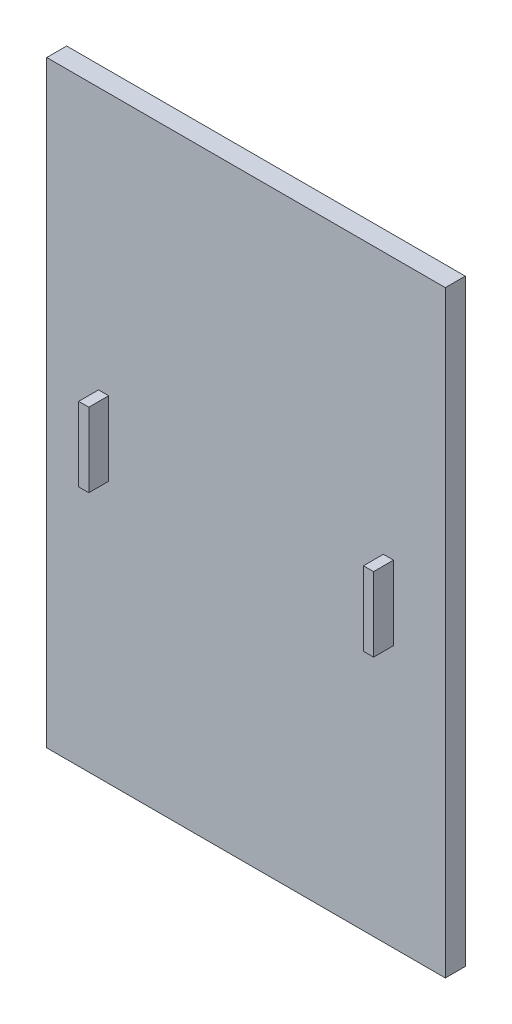
ISO-10303-21;
HEADER;
FILE_DESCRIPTION(('STEP AP214'),'2;1');
FILE_NAME('part.step','',(''),(''),'','','');
FILE_SCHEMA(('AUTOMOTIVE_DESIGN { 1 0 10303 214 1 1 1 1 }'));
ENDSEC;
DATA;
#1=APPLICATION_CONTEXT('core data for automotive mechanical design processes');
#2=APPLICATION_PROTOCOL_DEFINITION('international standard','automotive_design',2000,#1);
#3=PRODUCT_CONTEXT('',#1,'mechanical');
#4=PRODUCT('Part','Part','',(#3));
#5=PRODUCT_RELATED_PRODUCT_CATEGORY('part','',(#4));
#6=PRODUCT_DEFINITION_FORMATION('','',#4);
#7=PRODUCT_DEFINITION_CONTEXT('part definition',#1,'design');
#8=PRODUCT_DEFINITION('design','',#6,#7);
#9=PRODUCT_DEFINITION_SHAPE('','',#8);
#10=(LENGTH_UNIT() NAMED_UNIT(*) SI_UNIT(.MILLI.,.METRE.));
#11=(NAMED_UNIT(*) PLANE_ANGLE_UNIT() SI_UNIT($,.RADIAN.));
#12=(NAMED_UNIT(*) SI_UNIT($,.STERADIAN.) SOLID_ANGLE_UNIT());
#13=UNCERTAINTY_MEASURE_WITH_UNIT(LENGTH_MEASURE(1.E-05),#10,'distance_accuracy_value','');
#14=(GEOMETRIC_REPRESENTATION_CONTEXT(3) GLOBAL_UNCERTAINTY_ASSIGNED_CONTEXT((#13)) GLOBAL_UNIT_ASSIGNED_CONTEXT((#10,
#11,#12)) REPRESENTATION_CONTEXT('',''));
#15=CARTESIAN_POINT('',(0.,0.,0.));
#16=DIRECTION('',(0.,0.,1.));
#17=DIRECTION('',(1.,0.,0.));
#18=AXIS2_PLACEMENT_3D('',#15,#16,#17);
#19=CARTESIAN_POINT('',(0.,0.,5.));
#20=DIRECTION('',(0.,0.,1.));
#21=DIRECTION('',(1.,0.,0.));
#22=AXIS2_PLACEMENT_3D('',#19,#20,#21);
#23=PLANE('',#22);
#24=DIRECTION('',(0.,1.,0.));
#25=VECTOR('',#24,1.);
#26=CARTESIAN_POINT('',(34.4518078033703,9.29189619173818,5.));
#27=LINE('',#26,#25);
#28=CARTESIAN_POINT('',(34.4518078033703,-9.29189619173818,5.));
#29=VERTEX_POINT('',#28);
#30=CARTESIAN_POINT('',(34.4518078033703,9.29189619173818,5.));
#31=VERTEX_POINT('',#30);
#32=EDGE_CURVE('E127',#29,#31,#27,.T.);
#33=ORIENTED_EDGE('',*,*,#32,.T.);
#34=DIRECTION('',(1.,0.,0.));
#35=VECTOR('',#34,1.);
#36=CARTESIAN_POINT('',(36.99502297154,9.29189619173818,5.));
#37=LINE('',#36,#35);
#38=CARTESIAN_POINT('',(36.99502297154,9.29189619173818,5.));
#39=VERTEX_POINT('',#38);
#40=EDGE_CURVE('E141',#31,#39,#37,.T.);
#41=ORIENTED_EDGE('',*,*,#40,.T.);
#42=DIRECTION('',(0.,-1.,0.));
#43=VECTOR('',#42,1.);
#44=CARTESIAN_POINT('',(36.99502297154,9.29189619173818,5.));
#45=LINE('',#44,#43);
#46=CARTESIAN_POINT('',(36.99502297154,-9.29189619173818,5.));
#47=VERTEX_POINT('',#46);
#48=EDGE_CURVE('E53',#39,#47,#45,.T.);
#49=ORIENTED_EDGE('',*,*,#48,.T.);
#50=DIRECTION('',(-1.,0.,0.));
#51=VECTOR('',#50,1.);
#52=CARTESIAN_POINT('',(36.99502297154,-9.29189619173818,5.));
#53=LINE('',#52,#51);
#54=EDGE_CURVE('E48',#47,#29,#53,.T.);
#55=ORIENTED_EDGE('',*,*,#54,.T.);
#56=EDGE_LOOP('',(#33,#41,#49,#55));
#57=FACE_BOUND('',#56,.T.);
#58=DIRECTION('',(0.,1.,0.));
#59=VECTOR('',#58,1.);
#60=CARTESIAN_POINT('',(50.,75.,5.));
#61=LINE('',#60,#59);
#62=CARTESIAN_POINT('',(50.,-75.,5.));
#63=VERTEX_POINT('',#62);
#64=CARTESIAN_POINT('',(50.,75.,5.));
#65=VERTEX_POINT('',#64);
#66=EDGE_CURVE('E188',#63,#65,#61,.T.);
#67=ORIENTED_EDGE('',*,*,#66,.T.);
#68=DIRECTION('',(-1.,0.,0.));
#69=VECTOR('',#68,1.);
#70=CARTESIAN_POINT('',(-50.,75.,5.));
#71=LINE('',#70,#69);
#72=CARTESIAN_POINT('',(-50.,75.,5.));
#73=VERTEX_POINT('',#72);
#74=EDGE_CURVE('E191',#65,#73,#71,.T.);
#75=ORIENTED_EDGE('',*,*,#74,.T.);
#76=DIRECTION('',(0.,-1.,0.));
#77=VECTOR('',#76,1.);
#78=CARTESIAN_POINT('',(-50.,75.,5.));
#79=LINE('',#78,#77);
#80=CARTESIAN_POINT('',(-50.,-75.,5.));
#81=VERTEX_POINT('',#80);
#82=EDGE_CURVE('E194',#73,#81,#79,.T.);
#83=ORIENTED_EDGE('',*,*,#82,.T.);
#84=DIRECTION('',(1.,0.,0.));
#85=VECTOR('',#84,1.);
#86=CARTESIAN_POINT('',(-50.,-75.,5.));
#87=LINE('',#86,#85);
#88=EDGE_CURVE('E196',#81,#63,#87,.T.);
#89=ORIENTED_EDGE('',*,*,#88,.T.);
#90=EDGE_LOOP('',(#67,#75,#83,#89));
#91=FACE_BOUND('',#90,.T.);
#92=DIRECTION('',(-1.,0.,0.));
#93=VECTOR('',#92,1.);
#94=CARTESIAN_POINT('',(-36.99502297154,9.29189619173818,5.));
#95=LINE('',#94,#93);
#96=CARTESIAN_POINT('',(-34.4518078033703,9.29189619173818,5.));
#97=VERTEX_POINT('',#96);
#98=CARTESIAN_POINT('',(-36.99502297154,9.29189619173818,5.));
#99=VERTEX_POINT('',#98);
#100=EDGE_CURVE('E172',#97,#99,#95,.T.);
#101=ORIENTED_EDGE('',*,*,#100,.F.);
#102=DIRECTION('',(0.,1.,0.));
#103=VECTOR('',#102,1.);
#104=CARTESIAN_POINT('',(-34.4518078033703,9.29189619173818,5.));
#105=LINE('',#104,#103);
#106=CARTESIAN_POINT('',(-34.4518078033703,-9.29189619173818,5.));
#107=VERTEX_POINT('',#106);
#108=EDGE_CURVE('E130',#107,#97,#105,.T.);
#109=ORIENTED_EDGE('',*,*,#108,.F.);
#110=DIRECTION('',(1.,0.,0.));
#111=VECTOR('',#110,1.);
#112=CARTESIAN_POINT('',(-36.99502297154,-9.29189619173818,5.));
#113=LINE('',#112,#111);
#114=CARTESIAN_POINT('',(-36.99502297154,-9.29189619173818,5.));
#115=VERTEX_POINT('',#114);
#116=EDGE_CURVE('E163',#115,#107,#113,.T.);
#117=ORIENTED_EDGE('',*,*,#116,.F.);
#118=DIRECTION('',(0.,-1.,0.));
#119=VECTOR('',#118,1.);
#120=CARTESIAN_POINT('',(-36.99502297154,9.29189619173818,5.));
#121=LINE('',#120,#119);
#122=EDGE_CURVE('E174',#99,#115,#121,.T.);
#123=ORIENTED_EDGE('',*,*,#122,.F.);
#124=EDGE_LOOP('',(#101,#109,#117,#123));
#125=FACE_BOUND('',#124,.T.);
#126=ADVANCED_FACE('F33',(#57,#91,#125),#23,.T.);
#127=CARTESIAN_POINT('',(50.,75.,5.));
#128=DIRECTION('',(-1.,0.,0.));
#129=DIRECTION('',(0.,-1.,0.));
#130=AXIS2_PLACEMENT_3D('',#127,#128,#129);
#131=PLANE('',#130);
#132=DIRECTION('',(0.,1.,0.));
#133=VECTOR('',#132,1.);
#134=CARTESIAN_POINT('',(50.,75.,0.));
#135=LINE('',#134,#133);
#136=CARTESIAN_POINT('',(50.,-75.,0.));
#137=VERTEX_POINT('',#136);
#138=CARTESIAN_POINT('',(50.,75.,0.));
#139=VERTEX_POINT('',#138);
#140=EDGE_CURVE('E187',#137,#139,#135,.T.);
#141=ORIENTED_EDGE('',*,*,#140,.T.);
#142=DIRECTION('',(0.,0.,-1.));
#143=VECTOR('',#142,1.);
#144=CARTESIAN_POINT('',(50.,75.,5.));
#145=LINE('',#144,#143);
#146=EDGE_CURVE('E11',#65,#139,#145,.T.);
#147=ORIENTED_EDGE('',*,*,#146,.F.);
#148=ORIENTED_EDGE('',*,*,#66,.F.);
#149=DIRECTION('',(0.,0.,-1.));
#150=VECTOR('',#149,1.);
#151=CARTESIAN_POINT('',(50.,-75.,5.));
#152=LINE('',#151,#150);
#153=EDGE_CURVE('E198',#63,#137,#152,.T.);
#154=ORIENTED_EDGE('',*,*,#153,.T.);
#155=EDGE_LOOP('',(#141,#147,#148,#154));
#156=FACE_BOUND('',#155,.T.);
#157=ADVANCED_FACE('F35',(#156),#131,.F.);
#158=CARTESIAN_POINT('',(-50.,75.,5.));
#159=DIRECTION('',(0.,-1.,0.));
#160=DIRECTION('',(0.,0.,-1.));
#161=AXIS2_PLACEMENT_3D('',#158,#159,#160);
#162=PLANE('',#161);
#163=DIRECTION('',(-1.,0.,0.));
#164=VECTOR('',#163,1.);
#165=CARTESIAN_POINT('',(-50.,75.,0.));
#166=LINE('',#165,#164);
#167=CARTESIAN_POINT('',(-50.,75.,0.));
#168=VERTEX_POINT('',#167);
#169=EDGE_CURVE('E201',#139,#168,#166,.T.);
#170=ORIENTED_EDGE('',*,*,#169,.T.);
#171=DIRECTION('',(0.,0.,-1.));
#172=VECTOR('',#171,1.);
#173=CARTESIAN_POINT('',(-50.,75.,5.));
#174=LINE('',#173,#172);
#175=EDGE_CURVE('E41',#73,#168,#174,.T.);
#176=ORIENTED_EDGE('',*,*,#175,.F.);
#177=ORIENTED_EDGE('',*,*,#74,.F.);
#178=ORIENTED_EDGE('',*,*,#146,.T.);
#179=EDGE_LOOP('',(#170,#176,#177,#178));
#180=FACE_BOUND('',#179,.T.);
#181=ADVANCED_FACE('F231',(#180),#162,.F.);
#182=CARTESIAN_POINT('',(-50.,75.,5.));
#183=DIRECTION('',(1.,0.,0.));
#184=DIRECTION('',(0.,1.,0.));
#185=AXIS2_PLACEMENT_3D('',#182,#183,#184);
#186=PLANE('',#185);
#187=DIRECTION('',(0.,-1.,0.));
#188=VECTOR('',#187,1.);
#189=CARTESIAN_POINT('',(-50.,75.,0.));
#190=LINE('',#189,#188);
#191=CARTESIAN_POINT('',(-50.,-75.,0.));
#192=VERTEX_POINT('',#191);
#193=EDGE_CURVE('E203',#168,#192,#190,.T.);
#194=ORIENTED_EDGE('',*,*,#193,.T.);
#195=DIRECTION('',(0.,0.,-1.));
#196=VECTOR('',#195,1.);
#197=CARTESIAN_POINT('',(-50.,-75.,5.));
#198=LINE('',#197,#196);
#199=EDGE_CURVE('E208',#81,#192,#198,.T.);
#200=ORIENTED_EDGE('',*,*,#199,.F.);
#201=ORIENTED_EDGE('',*,*,#82,.F.);
#202=ORIENTED_EDGE('',*,*,#175,.T.);
#203=EDGE_LOOP('',(#194,#200,#201,#202));
#204=FACE_BOUND('',#203,.T.);
#205=ADVANCED_FACE('F215',(#204),#186,.F.);
#206=CARTESIAN_POINT('',(-50.,-75.,5.));
#207=DIRECTION('',(0.,1.,0.));
#208=DIRECTION('',(0.,0.,1.));
#209=AXIS2_PLACEMENT_3D('',#206,#207,#208);
#210=PLANE('',#209);
#211=DIRECTION('',(1.,0.,0.));
#212=VECTOR('',#211,1.);
#213=CARTESIAN_POINT('',(-50.,-75.,0.));
#214=LINE('',#213,#212);
#215=EDGE_CURVE('E192',#192,#137,#214,.T.);
#216=ORIENTED_EDGE('',*,*,#215,.T.);
#217=ORIENTED_EDGE('',*,*,#153,.F.);
#218=ORIENTED_EDGE('',*,*,#88,.F.);
#219=ORIENTED_EDGE('',*,*,#199,.T.);
#220=EDGE_LOOP('',(#216,#217,#218,#219));
#221=FACE_BOUND('',#220,.T.);
#222=ADVANCED_FACE('F224',(#221),#210,.F.);
#223=CARTESIAN_POINT('',(0.,0.,0.));
#224=DIRECTION('',(0.,0.,1.));
#225=DIRECTION('',(1.,0.,0.));
#226=AXIS2_PLACEMENT_3D('',#223,#224,#225);
#227=PLANE('',#226);
#228=ORIENTED_EDGE('',*,*,#140,.F.);
#229=ORIENTED_EDGE('',*,*,#215,.F.);
#230=ORIENTED_EDGE('',*,*,#193,.F.);
#231=ORIENTED_EDGE('',*,*,#169,.F.);
#232=EDGE_LOOP('',(#228,#229,#230,#231));
#233=FACE_BOUND('',#232,.T.);
#234=ADVANCED_FACE('F221',(#233),#227,.F.);
#235=CARTESIAN_POINT('',(-34.4518078033703,9.29189619173818,10.));
#236=DIRECTION('',(-1.,0.,0.));
#237=DIRECTION('',(0.,0.,1.));
#238=AXIS2_PLACEMENT_3D('',#235,#236,#237);
#239=PLANE('',#238);
#240=ORIENTED_EDGE('',*,*,#108,.T.);
#241=DIRECTION('',(0.,0.,-1.));
#242=VECTOR('',#241,1.);
#243=CARTESIAN_POINT('',(-34.4518078033703,9.29189619173818,10.));
#244=LINE('',#243,#242);
#245=CARTESIAN_POINT('',(-34.4518078033703,9.29189619173818,10.));
#246=VERTEX_POINT('',#245);
#247=EDGE_CURVE('E185',#246,#97,#244,.T.);
#248=ORIENTED_EDGE('',*,*,#247,.F.);
#249=DIRECTION('',(0.,1.,0.));
#250=VECTOR('',#249,1.);
#251=CARTESIAN_POINT('',(-34.4518078033703,9.29189619173818,10.));
#252=LINE('',#251,#250);
#253=CARTESIAN_POINT('',(-34.4518078033703,-9.29189619173818,10.));
#254=VERTEX_POINT('',#253);
#255=EDGE_CURVE('E159',#254,#246,#252,.T.);
#256=ORIENTED_EDGE('',*,*,#255,.F.);
#257=DIRECTION('',(0.,0.,-1.));
#258=VECTOR('',#257,1.);
#259=CARTESIAN_POINT('',(-34.4518078033703,-9.29189619173818,10.));
#260=LINE('',#259,#258);
#261=EDGE_CURVE('E169',#254,#107,#260,.T.);
#262=ORIENTED_EDGE('',*,*,#261,.T.);
#263=EDGE_LOOP('',(#240,#248,#256,#262));
#264=FACE_BOUND('',#263,.T.);
#265=ADVANCED_FACE('F244',(#264),#239,.F.);
#266=CARTESIAN_POINT('',(-36.99502297154,9.29189619173818,10.));
#267=DIRECTION('',(0.,-1.,0.));
#268=DIRECTION('',(0.,0.,-1.));
#269=AXIS2_PLACEMENT_3D('',#266,#267,#268);
#270=PLANE('',#269);
#271=ORIENTED_EDGE('',*,*,#100,.T.);
#272=DIRECTION('',(0.,0.,-1.));
#273=VECTOR('',#272,1.);
#274=CARTESIAN_POINT('',(-36.99502297154,9.29189619173818,10.));
#275=LINE('',#274,#273);
#276=CARTESIAN_POINT('',(-36.99502297154,9.29189619173818,10.));
#277=VERTEX_POINT('',#276);
#278=EDGE_CURVE('E182',#277,#99,#275,.T.);
#279=ORIENTED_EDGE('',*,*,#278,.F.);
#280=DIRECTION('',(-1.,0.,0.));
#281=VECTOR('',#280,1.);
#282=CARTESIAN_POINT('',(-36.99502297154,9.29189619173818,10.));
#283=LINE('',#282,#281);
#284=EDGE_CURVE('E162',#246,#277,#283,.T.);
#285=ORIENTED_EDGE('',*,*,#284,.F.);
#286=ORIENTED_EDGE('',*,*,#247,.T.);
#287=EDGE_LOOP('',(#271,#279,#285,#286));
#288=FACE_BOUND('',#287,.T.);
#289=ADVANCED_FACE('F263',(#288),#270,.F.);
#290=CARTESIAN_POINT('',(-36.99502297154,9.29189619173818,10.));
#291=DIRECTION('',(1.,0.,0.));
#292=DIRECTION('',(0.,0.,-1.));
#293=AXIS2_PLACEMENT_3D('',#290,#291,#292);
#294=PLANE('',#293);
#295=ORIENTED_EDGE('',*,*,#122,.T.);
#296=DIRECTION('',(0.,0.,-1.));
#297=VECTOR('',#296,1.);
#298=CARTESIAN_POINT('',(-36.99502297154,-9.29189619173818,10.));
#299=LINE('',#298,#297);
#300=CARTESIAN_POINT('',(-36.99502297154,-9.29189619173818,10.));
#301=VERTEX_POINT('',#300);
#302=EDGE_CURVE('E180',#301,#115,#299,.T.);
#303=ORIENTED_EDGE('',*,*,#302,.F.);
#304=DIRECTION('',(0.,-1.,0.));
#305=VECTOR('',#304,1.);
#306=CARTESIAN_POINT('',(-36.99502297154,9.29189619173818,10.));
#307=LINE('',#306,#305);
#308=EDGE_CURVE('E165',#277,#301,#307,.T.);
#309=ORIENTED_EDGE('',*,*,#308,.F.);
#310=ORIENTED_EDGE('',*,*,#278,.T.);
#311=EDGE_LOOP('',(#295,#303,#309,#310));
#312=FACE_BOUND('',#311,.T.);
#313=ADVANCED_FACE('F270',(#312),#294,.F.);
#314=CARTESIAN_POINT('',(-36.99502297154,-9.29189619173818,10.));
#315=DIRECTION('',(0.,1.,0.));
#316=DIRECTION('',(0.,0.,1.));
#317=AXIS2_PLACEMENT_3D('',#314,#315,#316);
#318=PLANE('',#317);
#319=ORIENTED_EDGE('',*,*,#116,.T.);
#320=ORIENTED_EDGE('',*,*,#261,.F.);
#321=DIRECTION('',(1.,0.,0.));
#322=VECTOR('',#321,1.);
#323=CARTESIAN_POINT('',(-36.99502297154,-9.29189619173818,10.));
#324=LINE('',#323,#322);
#325=EDGE_CURVE('E167',#301,#254,#324,.T.);
#326=ORIENTED_EDGE('',*,*,#325,.F.);
#327=ORIENTED_EDGE('',*,*,#302,.T.);
#328=EDGE_LOOP('',(#319,#320,#326,#327));
#329=FACE_BOUND('',#328,.T.);
#330=ADVANCED_FACE('F277',(#329),#318,.F.);
#331=CARTESIAN_POINT('',(0.,0.,10.));
#332=DIRECTION('',(0.,0.,1.));
#333=DIRECTION('',(1.,0.,0.));
#334=AXIS2_PLACEMENT_3D('',#331,#332,#333);
#335=PLANE('',#334);
#336=ORIENTED_EDGE('',*,*,#255,.T.);
#337=ORIENTED_EDGE('',*,*,#284,.T.);
#338=ORIENTED_EDGE('',*,*,#308,.T.);
#339=ORIENTED_EDGE('',*,*,#325,.T.);
#340=EDGE_LOOP('',(#336,#337,#338,#339));
#341=FACE_BOUND('',#340,.T.);
#342=ADVANCED_FACE('F285',(#341),#335,.T.);
#343=CARTESIAN_POINT('',(34.4518078033703,9.29189619173818,10.));
#344=DIRECTION('',(-1.,0.,0.));
#345=DIRECTION('',(0.,0.,1.));
#346=AXIS2_PLACEMENT_3D('',#343,#344,#345);
#347=PLANE('',#346);
#348=ORIENTED_EDGE('',*,*,#32,.F.);
#349=DIRECTION('',(0.,0.,-1.));
#350=VECTOR('',#349,1.);
#351=CARTESIAN_POINT('',(34.4518078033703,-9.29189619173818,10.));
#352=LINE('',#351,#350);
#353=CARTESIAN_POINT('',(34.4518078033703,-9.29189619173818,10.));
#354=VERTEX_POINT('',#353);
#355=EDGE_CURVE('E121',#354,#29,#352,.T.);
#356=ORIENTED_EDGE('',*,*,#355,.F.);
#357=DIRECTION('',(0.,1.,0.));
#358=VECTOR('',#357,1.);
#359=CARTESIAN_POINT('',(34.4518078033703,9.29189619173818,10.));
#360=LINE('',#359,#358);
#361=CARTESIAN_POINT('',(34.4518078033703,9.29189619173818,10.));
#362=VERTEX_POINT('',#361);
#363=EDGE_CURVE('E125',#354,#362,#360,.T.);
#364=ORIENTED_EDGE('',*,*,#363,.T.);
#365=DIRECTION('',(0.,0.,-1.));
#366=VECTOR('',#365,1.);
#367=CARTESIAN_POINT('',(34.4518078033703,9.29189619173818,10.));
#368=LINE('',#367,#366);
#369=EDGE_CURVE('E149',#362,#31,#368,.T.);
#370=ORIENTED_EDGE('',*,*,#369,.T.);
#371=EDGE_LOOP('',(#348,#356,#364,#370));
#372=FACE_BOUND('',#371,.T.);
#373=ADVANCED_FACE('F123',(#372),#347,.T.);
#374=CARTESIAN_POINT('',(36.99502297154,-9.29189619173818,10.));
#375=DIRECTION('',(0.,-1.,0.));
#376=DIRECTION('',(0.,0.,-1.));
#377=AXIS2_PLACEMENT_3D('',#374,#375,#376);
#378=PLANE('',#377);
#379=ORIENTED_EDGE('',*,*,#54,.F.);
#380=DIRECTION('',(0.,0.,-1.));
#381=VECTOR('',#380,1.);
#382=CARTESIAN_POINT('',(36.99502297154,-9.29189619173818,10.));
#383=LINE('',#382,#381);
#384=CARTESIAN_POINT('',(36.99502297154,-9.29189619173818,10.));
#385=VERTEX_POINT('',#384);
#386=EDGE_CURVE('E131',#385,#47,#383,.T.);
#387=ORIENTED_EDGE('',*,*,#386,.F.);
#388=DIRECTION('',(-1.,0.,0.));
#389=VECTOR('',#388,1.);
#390=CARTESIAN_POINT('',(36.99502297154,-9.29189619173818,10.));
#391=LINE('',#390,#389);
#392=EDGE_CURVE('E137',#385,#354,#391,.T.);
#393=ORIENTED_EDGE('',*,*,#392,.T.);
#394=ORIENTED_EDGE('',*,*,#355,.T.);
#395=EDGE_LOOP('',(#379,#387,#393,#394));
#396=FACE_BOUND('',#395,.T.);
#397=ADVANCED_FACE('F143',(#396),#378,.T.);
#398=CARTESIAN_POINT('',(36.99502297154,9.29189619173818,10.));
#399=DIRECTION('',(1.,0.,0.));
#400=DIRECTION('',(0.,0.,-1.));
#401=AXIS2_PLACEMENT_3D('',#398,#399,#400);
#402=PLANE('',#401);
#403=ORIENTED_EDGE('',*,*,#48,.F.);
#404=DIRECTION('',(0.,0.,-1.));
#405=VECTOR('',#404,1.);
#406=CARTESIAN_POINT('',(36.99502297154,9.29189619173818,10.));
#407=LINE('',#406,#405);
#408=CARTESIAN_POINT('',(36.99502297154,9.29189619173818,10.));
#409=VERTEX_POINT('',#408);
#410=EDGE_CURVE('E155',#409,#39,#407,.T.);
#411=ORIENTED_EDGE('',*,*,#410,.F.);
#412=DIRECTION('',(0.,-1.,0.));
#413=VECTOR('',#412,1.);
#414=CARTESIAN_POINT('',(36.99502297154,9.29189619173818,10.));
#415=LINE('',#414,#413);
#416=EDGE_CURVE('E144',#409,#385,#415,.T.);
#417=ORIENTED_EDGE('',*,*,#416,.T.);
#418=ORIENTED_EDGE('',*,*,#386,.T.);
#419=EDGE_LOOP('',(#403,#411,#417,#418));
#420=FACE_BOUND('',#419,.T.);
#421=ADVANCED_FACE('F306',(#420),#402,.T.);
#422=CARTESIAN_POINT('',(36.99502297154,9.29189619173818,10.));
#423=DIRECTION('',(0.,1.,0.));
#424=DIRECTION('',(0.,0.,1.));
#425=AXIS2_PLACEMENT_3D('',#422,#423,#424);
#426=PLANE('',#425);
#427=ORIENTED_EDGE('',*,*,#40,.F.);
#428=ORIENTED_EDGE('',*,*,#369,.F.);
#429=DIRECTION('',(1.,0.,0.));
#430=VECTOR('',#429,1.);
#431=CARTESIAN_POINT('',(36.99502297154,9.29189619173818,10.));
#432=LINE('',#431,#430);
#433=EDGE_CURVE('E140',#362,#409,#432,.T.);
#434=ORIENTED_EDGE('',*,*,#433,.T.);
#435=ORIENTED_EDGE('',*,*,#410,.T.);
#436=EDGE_LOOP('',(#427,#428,#434,#435));
#437=FACE_BOUND('',#436,.T.);
#438=ADVANCED_FACE('F313',(#437),#426,.T.);
#439=CARTESIAN_POINT('',(0.,0.,10.));
#440=DIRECTION('',(0.,0.,1.));
#441=DIRECTION('',(-1.,0.,0.));
#442=AXIS2_PLACEMENT_3D('',#439,#440,#441);
#443=PLANE('',#442);
#444=ORIENTED_EDGE('',*,*,#363,.F.);
#445=ORIENTED_EDGE('',*,*,#392,.F.);
#446=ORIENTED_EDGE('',*,*,#416,.F.);
#447=ORIENTED_EDGE('',*,*,#433,.F.);
#448=EDGE_LOOP('',(#444,#445,#446,#447));
#449=FACE_BOUND('',#448,.T.);
#450=ADVANCED_FACE('F135',(#449),#443,.T.);
#451=CLOSED_SHELL('',(#126,#157,#181,#205,#222,#234,#265,#289,#313,#330,#342,#373,#397,#421,
#438,#450));
#452=MANIFOLD_SOLID_BREP('B2',#451);
#453=ADVANCED_BREP_SHAPE_REPRESENTATION('',(#18,#452),#14);
#454=SHAPE_DEFINITION_REPRESENTATION(#9,#453);
ENDSEC;
END-ISO-10303-21;
